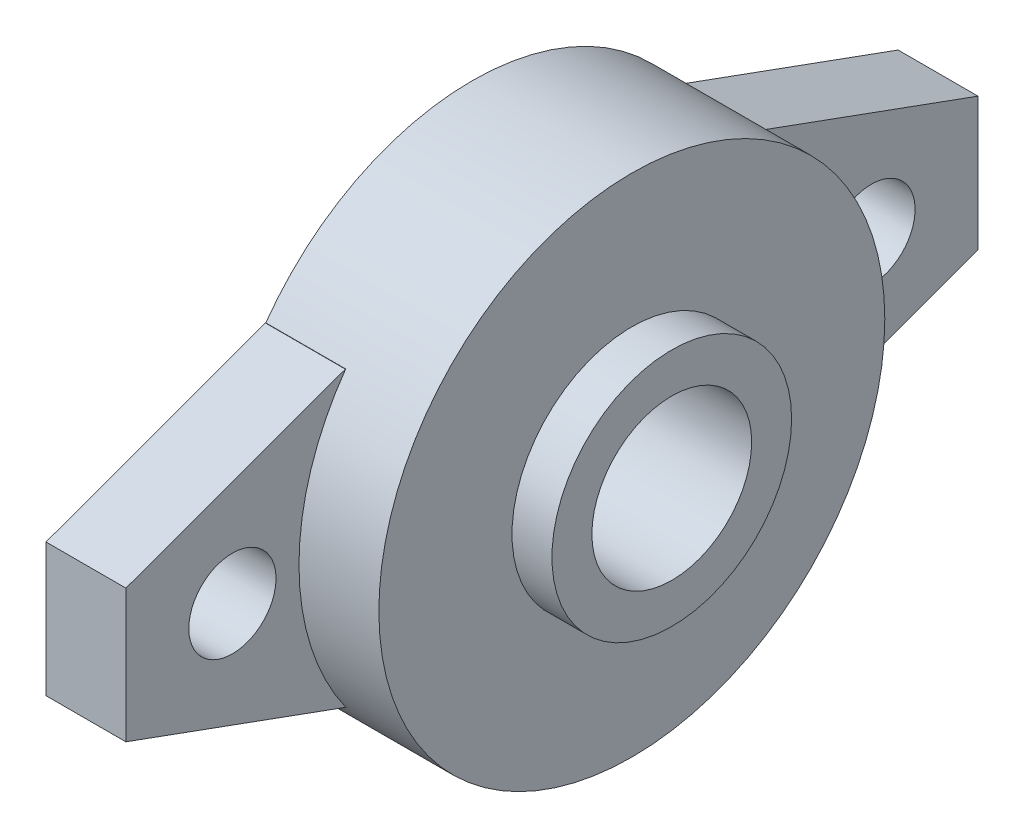
ISO-10303-21;
HEADER;
FILE_DESCRIPTION(('STEP AP214'),'2;1');
FILE_NAME('part.step','',(''),(''),'','','');
FILE_SCHEMA(('AUTOMOTIVE_DESIGN { 1 0 10303 214 1 1 1 1 }'));
ENDSEC;
DATA;
#1=APPLICATION_CONTEXT('core data for automotive mechanical design processes');
#2=APPLICATION_PROTOCOL_DEFINITION('international standard','automotive_design',2000,#1);
#3=PRODUCT_CONTEXT('',#1,'mechanical');
#4=PRODUCT('Part','Part','',(#3));
#5=PRODUCT_RELATED_PRODUCT_CATEGORY('part','',(#4));
#6=PRODUCT_DEFINITION_FORMATION('','',#4);
#7=PRODUCT_DEFINITION_CONTEXT('part definition',#1,'design');
#8=PRODUCT_DEFINITION('design','',#6,#7);
#9=PRODUCT_DEFINITION_SHAPE('','',#8);
#10=(LENGTH_UNIT() NAMED_UNIT(*) SI_UNIT(.MILLI.,.METRE.));
#11=(NAMED_UNIT(*) PLANE_ANGLE_UNIT() SI_UNIT($,.RADIAN.));
#12=(NAMED_UNIT(*) SI_UNIT($,.STERADIAN.) SOLID_ANGLE_UNIT());
#13=UNCERTAINTY_MEASURE_WITH_UNIT(LENGTH_MEASURE(1.E-05),#10,'distance_accuracy_value','');
#14=(GEOMETRIC_REPRESENTATION_CONTEXT(3) GLOBAL_UNCERTAINTY_ASSIGNED_CONTEXT((#13)) GLOBAL_UNIT_ASSIGNED_CONTEXT((#10,
#11,#12)) REPRESENTATION_CONTEXT('',''));
#15=CARTESIAN_POINT('',(0.,0.,0.));
#16=DIRECTION('',(0.,0.,1.));
#17=DIRECTION('',(1.,0.,0.));
#18=AXIS2_PLACEMENT_3D('',#15,#16,#17);
#19=CARTESIAN_POINT('',(12.,0.,0.));
#20=DIRECTION('',(-1.,0.,0.));
#21=DIRECTION('',(0.,0.,1.));
#22=AXIS2_PLACEMENT_3D('',#19,#20,#21);
#23=CYLINDRICAL_SURFACE('',#22,6.);
#24=CARTESIAN_POINT('',(15.,0.,0.));
#25=DIRECTION('',(1.,0.,0.));
#26=DIRECTION('',(0.,0.,-1.));
#27=AXIS2_PLACEMENT_3D('',#24,#25,#26);
#28=CIRCLE('',#27,6.);
#29=CARTESIAN_POINT('',(15.,0.,-6.));
#30=VERTEX_POINT('',#29);
#31=EDGE_CURVE('E188',#30,#30,#28,.T.);
#32=ORIENTED_EDGE('',*,*,#31,.T.);
#33=EDGE_LOOP('',(#32));
#34=FACE_BOUND('',#33,.T.);
#35=CARTESIAN_POINT('',(0.,0.,0.));
#36=DIRECTION('',(-1.,0.,0.));
#37=DIRECTION('',(0.,0.,1.));
#38=AXIS2_PLACEMENT_3D('',#35,#36,#37);
#39=CIRCLE('',#38,6.);
#40=CARTESIAN_POINT('',(0.,0.,6.));
#41=VERTEX_POINT('',#40);
#42=EDGE_CURVE('E306',#41,#41,#39,.T.);
#43=ORIENTED_EDGE('',*,*,#42,.T.);
#44=EDGE_LOOP('',(#43));
#45=FACE_BOUND('',#44,.T.);
#46=ADVANCED_FACE('F40',(#34,#45),#23,.F.);
#47=CARTESIAN_POINT('',(12.,0.,0.));
#48=DIRECTION('',(1.,0.,0.));
#49=DIRECTION('',(0.,0.,-1.));
#50=AXIS2_PLACEMENT_3D('',#47,#48,#49);
#51=PLANE('',#50);
#52=CARTESIAN_POINT('',(12.,0.,0.));
#53=DIRECTION('',(1.,0.,0.));
#54=DIRECTION('',(0.,0.,-1.));
#55=AXIS2_PLACEMENT_3D('',#52,#53,#54);
#56=CIRCLE('',#55,19.);
#57=CARTESIAN_POINT('',(12.,0.,-19.));
#58=VERTEX_POINT('',#57);
#59=EDGE_CURVE('E146',#58,#58,#56,.T.);
#60=ORIENTED_EDGE('',*,*,#59,.T.);
#61=EDGE_LOOP('',(#60));
#62=FACE_BOUND('',#61,.T.);
#63=CARTESIAN_POINT('',(12.,0.,0.));
#64=DIRECTION('',(1.,0.,0.));
#65=DIRECTION('',(0.,0.,-1.));
#66=AXIS2_PLACEMENT_3D('',#63,#64,#65);
#67=CIRCLE('',#66,9.);
#68=CARTESIAN_POINT('',(12.,0.,-9.));
#69=VERTEX_POINT('',#68);
#70=EDGE_CURVE('E192',#69,#69,#67,.T.);
#71=ORIENTED_EDGE('',*,*,#70,.F.);
#72=EDGE_LOOP('',(#71));
#73=FACE_BOUND('',#72,.T.);
#74=ADVANCED_FACE('F317',(#62,#73),#51,.T.);
#75=CARTESIAN_POINT('',(0.,0.,0.));
#76=DIRECTION('',(1.,0.,0.));
#77=DIRECTION('',(0.,0.,-1.));
#78=AXIS2_PLACEMENT_3D('',#75,#76,#77);
#79=PLANE('',#78);
#80=ORIENTED_EDGE('',*,*,#42,.F.);
#81=EDGE_LOOP('',(#80));
#82=FACE_BOUND('',#81,.T.);
#83=CARTESIAN_POINT('',(0.,0.,24.));
#84=DIRECTION('',(-1.,0.,0.));
#85=DIRECTION('',(0.,0.,1.));
#86=AXIS2_PLACEMENT_3D('',#83,#84,#85);
#87=CIRCLE('',#86,3.27585332052941);
#88=CARTESIAN_POINT('',(0.,0.,27.2758533205294));
#89=VERTEX_POINT('',#88);
#90=EDGE_CURVE('E302',#89,#89,#87,.T.);
#91=ORIENTED_EDGE('',*,*,#90,.F.);
#92=EDGE_LOOP('',(#91));
#93=FACE_BOUND('',#92,.T.);
#94=CARTESIAN_POINT('',(0.,0.,-24.));
#95=DIRECTION('',(-1.,0.,0.));
#96=DIRECTION('',(0.,0.,1.));
#97=AXIS2_PLACEMENT_3D('',#94,#95,#96);
#98=CIRCLE('',#97,3.27585332052941);
#99=CARTESIAN_POINT('',(0.,0.,-20.7241466794706));
#100=VERTEX_POINT('',#99);
#101=EDGE_CURVE('E294',#100,#100,#98,.T.);
#102=ORIENTED_EDGE('',*,*,#101,.F.);
#103=EDGE_LOOP('',(#102));
#104=FACE_BOUND('',#103,.T.);
#105=DIRECTION('',(0.,0.,1.));
#106=VECTOR('',#105,1.);
#107=CARTESIAN_POINT('',(0.,-11.,32.));
#108=LINE('',#107,#106);
#109=CARTESIAN_POINT('',(0.,-11.,15.4919333848297));
#110=VERTEX_POINT('',#109);
#111=CARTESIAN_POINT('',(0.,-11.,15.5151354832722));
#112=VERTEX_POINT('',#111);
#113=EDGE_CURVE('E178',#110,#112,#108,.T.);
#114=ORIENTED_EDGE('',*,*,#113,.T.);
#115=DIRECTION('',(0.,-0.342020143325669,-0.939692620785908));
#116=VECTOR('',#115,1.);
#117=CARTESIAN_POINT('',(0.,-11.,15.5151354832722));
#118=LINE('',#117,#116);
#119=CARTESIAN_POINT('',(0.,-4.99999999999998,32.));
#120=VERTEX_POINT('',#119);
#121=EDGE_CURVE('E224',#112,#120,#118,.F.);
#122=ORIENTED_EDGE('',*,*,#121,.T.);
#123=DIRECTION('',(0.,1.,0.));
#124=VECTOR('',#123,1.);
#125=CARTESIAN_POINT('',(0.,-11.,32.));
#126=LINE('',#125,#124);
#127=CARTESIAN_POINT('',(0.,5.,32.));
#128=VERTEX_POINT('',#127);
#129=EDGE_CURVE('E165',#120,#128,#126,.T.);
#130=ORIENTED_EDGE('',*,*,#129,.T.);
#131=DIRECTION('',(0.,-0.342020143325669,0.939692620785908));
#132=VECTOR('',#131,1.);
#133=CARTESIAN_POINT('',(0.,5.,32.));
#134=LINE('',#133,#132);
#135=CARTESIAN_POINT('',(0.,11.,15.5151354832723));
#136=VERTEX_POINT('',#135);
#137=EDGE_CURVE('E218',#128,#136,#134,.F.);
#138=ORIENTED_EDGE('',*,*,#137,.T.);
#139=DIRECTION('',(0.,0.,-1.));
#140=VECTOR('',#139,1.);
#141=CARTESIAN_POINT('',(0.,11.,32.));
#142=LINE('',#141,#140);
#143=CARTESIAN_POINT('',(0.,11.,15.4919333848297));
#144=VERTEX_POINT('',#143);
#145=EDGE_CURVE('E141',#136,#144,#142,.T.);
#146=ORIENTED_EDGE('',*,*,#145,.T.);
#147=CARTESIAN_POINT('',(0.,0.,0.));
#148=DIRECTION('',(1.,0.,0.));
#149=DIRECTION('',(0.,0.,-1.));
#150=AXIS2_PLACEMENT_3D('',#147,#148,#149);
#151=CIRCLE('',#150,19.);
#152=CARTESIAN_POINT('',(0.,11.,-15.4919333848297));
#153=VERTEX_POINT('',#152);
#154=EDGE_CURVE('E134',#153,#144,#151,.T.);
#155=ORIENTED_EDGE('',*,*,#154,.F.);
#156=CARTESIAN_POINT('',(0.,11.,-15.5151354832723));
#157=VERTEX_POINT('',#156);
#158=EDGE_CURVE('E139',#153,#157,#142,.T.);
#159=ORIENTED_EDGE('',*,*,#158,.T.);
#160=DIRECTION('',(0.,0.342020143325669,0.939692620785908));
#161=VECTOR('',#160,1.);
#162=CARTESIAN_POINT('',(0.,11.,-15.5151354832723));
#163=LINE('',#162,#161);
#164=CARTESIAN_POINT('',(0.,5.,-32.));
#165=VERTEX_POINT('',#164);
#166=EDGE_CURVE('E215',#157,#165,#163,.F.);
#167=ORIENTED_EDGE('',*,*,#166,.T.);
#168=DIRECTION('',(0.,-1.,0.));
#169=VECTOR('',#168,1.);
#170=CARTESIAN_POINT('',(0.,-11.,-32.));
#171=LINE('',#170,#169);
#172=CARTESIAN_POINT('',(0.,-5.,-32.));
#173=VERTEX_POINT('',#172);
#174=EDGE_CURVE('E169',#165,#173,#171,.T.);
#175=ORIENTED_EDGE('',*,*,#174,.T.);
#176=DIRECTION('',(0.,0.342020143325669,-0.939692620785908));
#177=VECTOR('',#176,1.);
#178=CARTESIAN_POINT('',(0.,-4.99999999999999,-32.));
#179=LINE('',#178,#177);
#180=CARTESIAN_POINT('',(0.,-11.,-15.5151354832723));
#181=VERTEX_POINT('',#180);
#182=EDGE_CURVE('E221',#173,#181,#179,.F.);
#183=ORIENTED_EDGE('',*,*,#182,.T.);
#184=CARTESIAN_POINT('',(0.,-11.,-15.4919333848297));
#185=VERTEX_POINT('',#184);
#186=EDGE_CURVE('E179',#181,#185,#108,.T.);
#187=ORIENTED_EDGE('',*,*,#186,.T.);
#188=EDGE_CURVE('E147',#110,#185,#151,.T.);
#189=ORIENTED_EDGE('',*,*,#188,.F.);
#190=EDGE_LOOP('',(#114,#122,#130,#138,#146,#155,#159,#167,#175,#183,#187,#189));
#191=FACE_BOUND('',#190,.T.);
#192=ADVANCED_FACE('F137',(#82,#93,#104,#191),#79,.F.);
#193=CARTESIAN_POINT('',(12.,0.,0.));
#194=DIRECTION('',(-1.,0.,0.));
#195=DIRECTION('',(0.,0.,1.));
#196=AXIS2_PLACEMENT_3D('',#193,#194,#195);
#197=CYLINDRICAL_SURFACE('',#196,19.);
#198=ORIENTED_EDGE('',*,*,#188,.T.);
#199=DIRECTION('',(-1.,0.,0.));
#200=VECTOR('',#199,1.);
#201=CARTESIAN_POINT('',(12.,-11.,-15.4919333848297));
#202=LINE('',#201,#200);
#203=CARTESIAN_POINT('',(6.,-11.,-15.4919333848297));
#204=VERTEX_POINT('',#203);
#205=EDGE_CURVE('E159',#185,#204,#202,.F.);
#206=ORIENTED_EDGE('',*,*,#205,.T.);
#207=CARTESIAN_POINT('',(6.,0.,0.));
#208=DIRECTION('',(-1.,0.,0.));
#209=DIRECTION('',(0.,0.,1.));
#210=AXIS2_PLACEMENT_3D('',#207,#208,#209);
#211=CIRCLE('',#210,19.);
#212=CARTESIAN_POINT('',(6.,11.,-15.4919333848297));
#213=VERTEX_POINT('',#212);
#214=EDGE_CURVE('E156',#213,#204,#211,.T.);
#215=ORIENTED_EDGE('',*,*,#214,.F.);
#216=DIRECTION('',(-1.,0.,0.));
#217=VECTOR('',#216,1.);
#218=CARTESIAN_POINT('',(12.,11.,-15.4919333848297));
#219=LINE('',#218,#217);
#220=EDGE_CURVE('E150',#213,#153,#219,.T.);
#221=ORIENTED_EDGE('',*,*,#220,.T.);
#222=ORIENTED_EDGE('',*,*,#154,.T.);
#223=DIRECTION('',(-1.,0.,0.));
#224=VECTOR('',#223,1.);
#225=CARTESIAN_POINT('',(12.,11.,15.4919333848297));
#226=LINE('',#225,#224);
#227=CARTESIAN_POINT('',(6.,11.,15.4919333848297));
#228=VERTEX_POINT('',#227);
#229=EDGE_CURVE('E202',#144,#228,#226,.F.);
#230=ORIENTED_EDGE('',*,*,#229,.T.);
#231=CARTESIAN_POINT('',(6.,-11.,15.4919333848297));
#232=VERTEX_POINT('',#231);
#233=EDGE_CURVE('E183',#232,#228,#211,.T.);
#234=ORIENTED_EDGE('',*,*,#233,.F.);
#235=DIRECTION('',(-1.,0.,0.));
#236=VECTOR('',#235,1.);
#237=CARTESIAN_POINT('',(12.,-11.,15.4919333848297));
#238=LINE('',#237,#236);
#239=EDGE_CURVE('E160',#232,#110,#238,.T.);
#240=ORIENTED_EDGE('',*,*,#239,.T.);
#241=EDGE_LOOP('',(#198,#206,#215,#221,#222,#230,#234,#240));
#242=FACE_BOUND('',#241,.T.);
#243=ORIENTED_EDGE('',*,*,#59,.F.);
#244=EDGE_LOOP('',(#243));
#245=FACE_BOUND('',#244,.T.);
#246=ADVANCED_FACE('F152',(#242,#245),#197,.T.);
#247=CARTESIAN_POINT('',(15.,0.,0.));
#248=DIRECTION('',(1.,0.,0.));
#249=DIRECTION('',(0.,0.,-1.));
#250=AXIS2_PLACEMENT_3D('',#247,#248,#249);
#251=PLANE('',#250);
#252=CARTESIAN_POINT('',(15.,0.,0.));
#253=DIRECTION('',(1.,0.,0.));
#254=DIRECTION('',(0.,0.,-1.));
#255=AXIS2_PLACEMENT_3D('',#252,#253,#254);
#256=CIRCLE('',#255,9.);
#257=CARTESIAN_POINT('',(15.,0.,-9.));
#258=VERTEX_POINT('',#257);
#259=EDGE_CURVE('E193',#258,#258,#256,.T.);
#260=ORIENTED_EDGE('',*,*,#259,.T.);
#261=EDGE_LOOP('',(#260));
#262=FACE_BOUND('',#261,.T.);
#263=ORIENTED_EDGE('',*,*,#31,.F.);
#264=EDGE_LOOP('',(#263));
#265=FACE_BOUND('',#264,.T.);
#266=ADVANCED_FACE('F351',(#262,#265),#251,.T.);
#267=CARTESIAN_POINT('',(15.,0.,0.));
#268=DIRECTION('',(-1.,0.,0.));
#269=DIRECTION('',(0.,0.,1.));
#270=AXIS2_PLACEMENT_3D('',#267,#268,#269);
#271=CYLINDRICAL_SURFACE('',#270,9.);
#272=ORIENTED_EDGE('',*,*,#259,.F.);
#273=EDGE_LOOP('',(#272));
#274=FACE_BOUND('',#273,.T.);
#275=ORIENTED_EDGE('',*,*,#70,.T.);
#276=EDGE_LOOP('',(#275));
#277=FACE_BOUND('',#276,.T.);
#278=ADVANCED_FACE('F346',(#274,#277),#271,.T.);
#279=CARTESIAN_POINT('',(6.,-11.,32.));
#280=DIRECTION('',(0.,0.,1.));
#281=DIRECTION('',(0.,-1.,0.));
#282=AXIS2_PLACEMENT_3D('',#279,#280,#281);
#283=PLANE('',#282);
#284=ORIENTED_EDGE('',*,*,#129,.F.);
#285=DIRECTION('',(1.,0.,0.));
#286=VECTOR('',#285,1.);
#287=CARTESIAN_POINT('',(6.,-4.99999999999998,32.));
#288=LINE('',#287,#286);
#289=CARTESIAN_POINT('',(6.,-4.99999999999998,32.));
#290=VERTEX_POINT('',#289);
#291=EDGE_CURVE('E231',#120,#290,#288,.T.);
#292=ORIENTED_EDGE('',*,*,#291,.T.);
#293=DIRECTION('',(0.,1.,0.));
#294=VECTOR('',#293,1.);
#295=CARTESIAN_POINT('',(6.,-11.,32.));
#296=LINE('',#295,#294);
#297=CARTESIAN_POINT('',(6.,5.,32.));
#298=VERTEX_POINT('',#297);
#299=EDGE_CURVE('E182',#290,#298,#296,.T.);
#300=ORIENTED_EDGE('',*,*,#299,.T.);
#301=DIRECTION('',(-1.,0.,0.));
#302=VECTOR('',#301,1.);
#303=CARTESIAN_POINT('',(6.,5.,32.));
#304=LINE('',#303,#302);
#305=EDGE_CURVE('E227',#298,#128,#304,.T.);
#306=ORIENTED_EDGE('',*,*,#305,.T.);
#307=EDGE_LOOP('',(#284,#292,#300,#306));
#308=FACE_BOUND('',#307,.T.);
#309=ADVANCED_FACE('F274',(#308),#283,.T.);
#310=CARTESIAN_POINT('',(6.,0.,0.));
#311=DIRECTION('',(-1.,0.,0.));
#312=DIRECTION('',(0.,0.,1.));
#313=AXIS2_PLACEMENT_3D('',#310,#311,#312);
#314=PLANE('',#313);
#315=CARTESIAN_POINT('',(6.,0.,24.));
#316=DIRECTION('',(-1.,0.,0.));
#317=DIRECTION('',(0.,0.,1.));
#318=AXIS2_PLACEMENT_3D('',#315,#316,#317);
#319=CIRCLE('',#318,3.27585332052941);
#320=CARTESIAN_POINT('',(6.,0.,27.2758533205294));
#321=VERTEX_POINT('',#320);
#322=EDGE_CURVE('E298',#321,#321,#319,.T.);
#323=ORIENTED_EDGE('',*,*,#322,.T.);
#324=EDGE_LOOP('',(#323));
#325=FACE_BOUND('',#324,.T.);
#326=ORIENTED_EDGE('',*,*,#299,.F.);
#327=DIRECTION('',(0.,0.342020143325669,0.939692620785908));
#328=VECTOR('',#327,1.);
#329=CARTESIAN_POINT('',(6.,-11.,15.5151354832722));
#330=LINE('',#329,#328);
#331=CARTESIAN_POINT('',(6.,-11.,15.5151354832722));
#332=VERTEX_POINT('',#331);
#333=EDGE_CURVE('E237',#290,#332,#330,.F.);
#334=ORIENTED_EDGE('',*,*,#333,.T.);
#335=DIRECTION('',(0.,0.,1.));
#336=VECTOR('',#335,1.);
#337=CARTESIAN_POINT('',(6.,-11.,32.));
#338=LINE('',#337,#336);
#339=EDGE_CURVE('E285',#232,#332,#338,.T.);
#340=ORIENTED_EDGE('',*,*,#339,.F.);
#341=ORIENTED_EDGE('',*,*,#233,.T.);
#342=DIRECTION('',(0.,0.,-1.));
#343=VECTOR('',#342,1.);
#344=CARTESIAN_POINT('',(6.,11.,32.));
#345=LINE('',#344,#343);
#346=CARTESIAN_POINT('',(6.,11.,15.5151354832723));
#347=VERTEX_POINT('',#346);
#348=EDGE_CURVE('E258',#347,#228,#345,.T.);
#349=ORIENTED_EDGE('',*,*,#348,.F.);
#350=DIRECTION('',(0.,0.342020143325669,-0.939692620785908));
#351=VECTOR('',#350,1.);
#352=CARTESIAN_POINT('',(6.,5.,32.));
#353=LINE('',#352,#351);
#354=EDGE_CURVE('E234',#347,#298,#353,.F.);
#355=ORIENTED_EDGE('',*,*,#354,.T.);
#356=EDGE_LOOP('',(#326,#334,#340,#341,#349,#355));
#357=FACE_BOUND('',#356,.T.);
#358=ADVANCED_FACE('F263',(#325,#357),#314,.F.);
#359=CARTESIAN_POINT('',(6.,11.,32.));
#360=DIRECTION('',(0.,1.,0.));
#361=DIRECTION('',(0.,0.,1.));
#362=AXIS2_PLACEMENT_3D('',#359,#360,#361);
#363=PLANE('',#362);
#364=ORIENTED_EDGE('',*,*,#145,.F.);
#365=DIRECTION('',(1.,0.,0.));
#366=VECTOR('',#365,1.);
#367=CARTESIAN_POINT('',(6.,11.,15.5151354832723));
#368=LINE('',#367,#366);
#369=EDGE_CURVE('E50',#136,#347,#368,.T.);
#370=ORIENTED_EDGE('',*,*,#369,.T.);
#371=ORIENTED_EDGE('',*,*,#348,.T.);
#372=ORIENTED_EDGE('',*,*,#229,.F.);
#373=EDGE_LOOP('',(#364,#370,#371,#372));
#374=FACE_BOUND('',#373,.T.);
#375=ADVANCED_FACE('F257',(#374),#363,.T.);
#376=CARTESIAN_POINT('',(6.,-11.,32.));
#377=DIRECTION('',(0.,-1.,0.));
#378=DIRECTION('',(0.,0.,-1.));
#379=AXIS2_PLACEMENT_3D('',#376,#377,#378);
#380=PLANE('',#379);
#381=ORIENTED_EDGE('',*,*,#339,.T.);
#382=DIRECTION('',(-1.,0.,0.));
#383=VECTOR('',#382,1.);
#384=CARTESIAN_POINT('',(6.,-11.,15.5151354832722));
#385=LINE('',#384,#383);
#386=EDGE_CURVE('E211',#332,#112,#385,.T.);
#387=ORIENTED_EDGE('',*,*,#386,.T.);
#388=ORIENTED_EDGE('',*,*,#113,.F.);
#389=ORIENTED_EDGE('',*,*,#239,.F.);
#390=EDGE_LOOP('',(#381,#387,#388,#389));
#391=FACE_BOUND('',#390,.T.);
#392=ADVANCED_FACE('F283',(#391),#380,.T.);
#393=ORIENTED_EDGE('',*,*,#186,.F.);
#394=DIRECTION('',(1.,0.,0.));
#395=VECTOR('',#394,1.);
#396=CARTESIAN_POINT('',(6.,-11.,-15.5151354832723));
#397=LINE('',#396,#395);
#398=CARTESIAN_POINT('',(6.,-11.,-15.5151354832723));
#399=VERTEX_POINT('',#398);
#400=EDGE_CURVE('E65',#181,#399,#397,.T.);
#401=ORIENTED_EDGE('',*,*,#400,.T.);
#402=EDGE_CURVE('E187',#399,#204,#338,.T.);
#403=ORIENTED_EDGE('',*,*,#402,.T.);
#404=ORIENTED_EDGE('',*,*,#205,.F.);
#405=EDGE_LOOP('',(#393,#401,#403,#404));
#406=FACE_BOUND('',#405,.T.);
#407=ADVANCED_FACE('F462',(#406),#380,.T.);
#408=CARTESIAN_POINT('',(6.,11.,-15.5151354832723));
#409=VERTEX_POINT('',#408);
#410=EDGE_CURVE('E268',#213,#409,#345,.T.);
#411=ORIENTED_EDGE('',*,*,#410,.T.);
#412=DIRECTION('',(-1.,0.,0.));
#413=VECTOR('',#412,1.);
#414=CARTESIAN_POINT('',(6.,11.,-15.5151354832723));
#415=LINE('',#414,#413);
#416=EDGE_CURVE('E11',#409,#157,#415,.T.);
#417=ORIENTED_EDGE('',*,*,#416,.T.);
#418=ORIENTED_EDGE('',*,*,#158,.F.);
#419=ORIENTED_EDGE('',*,*,#220,.F.);
#420=EDGE_LOOP('',(#411,#417,#418,#419));
#421=FACE_BOUND('',#420,.T.);
#422=ADVANCED_FACE('F162',(#421),#363,.T.);
#423=CARTESIAN_POINT('',(6.,0.,-24.));
#424=DIRECTION('',(-1.,0.,0.));
#425=DIRECTION('',(0.,0.,1.));
#426=AXIS2_PLACEMENT_3D('',#423,#424,#425);
#427=CIRCLE('',#426,3.27585332052941);
#428=CARTESIAN_POINT('',(6.,0.,-20.7241466794706));
#429=VERTEX_POINT('',#428);
#430=EDGE_CURVE('E171',#429,#429,#427,.T.);
#431=ORIENTED_EDGE('',*,*,#430,.T.);
#432=EDGE_LOOP('',(#431));
#433=FACE_BOUND('',#432,.T.);
#434=ORIENTED_EDGE('',*,*,#402,.F.);
#435=DIRECTION('',(0.,-0.342020143325669,0.939692620785908));
#436=VECTOR('',#435,1.);
#437=CARTESIAN_POINT('',(6.,-4.99999999999999,-32.));
#438=LINE('',#437,#436);
#439=CARTESIAN_POINT('',(6.,-5.,-32.));
#440=VERTEX_POINT('',#439);
#441=EDGE_CURVE('E251',#399,#440,#438,.F.);
#442=ORIENTED_EDGE('',*,*,#441,.T.);
#443=DIRECTION('',(0.,-1.,0.));
#444=VECTOR('',#443,1.);
#445=CARTESIAN_POINT('',(6.,-11.,-32.));
#446=LINE('',#445,#444);
#447=CARTESIAN_POINT('',(6.,5.,-32.));
#448=VERTEX_POINT('',#447);
#449=EDGE_CURVE('E267',#448,#440,#446,.T.);
#450=ORIENTED_EDGE('',*,*,#449,.F.);
#451=DIRECTION('',(0.,-0.342020143325669,-0.939692620785908));
#452=VECTOR('',#451,1.);
#453=CARTESIAN_POINT('',(6.,11.,-15.5151354832723));
#454=LINE('',#453,#452);
#455=EDGE_CURVE('E57',#448,#409,#454,.F.);
#456=ORIENTED_EDGE('',*,*,#455,.T.);
#457=ORIENTED_EDGE('',*,*,#410,.F.);
#458=ORIENTED_EDGE('',*,*,#214,.T.);
#459=EDGE_LOOP('',(#434,#442,#450,#456,#457,#458));
#460=FACE_BOUND('',#459,.T.);
#461=ADVANCED_FACE('F382',(#433,#460),#314,.F.);
#462=CARTESIAN_POINT('',(6.,-11.,-32.));
#463=DIRECTION('',(0.,0.,-1.));
#464=DIRECTION('',(0.,1.,0.));
#465=AXIS2_PLACEMENT_3D('',#462,#463,#464);
#466=PLANE('',#465);
#467=ORIENTED_EDGE('',*,*,#449,.T.);
#468=DIRECTION('',(-1.,0.,0.));
#469=VECTOR('',#468,1.);
#470=CARTESIAN_POINT('',(6.,-5.,-32.));
#471=LINE('',#470,#469);
#472=EDGE_CURVE('E243',#440,#173,#471,.T.);
#473=ORIENTED_EDGE('',*,*,#472,.T.);
#474=ORIENTED_EDGE('',*,*,#174,.F.);
#475=DIRECTION('',(1.,0.,0.));
#476=VECTOR('',#475,1.);
#477=CARTESIAN_POINT('',(6.,5.,-32.));
#478=LINE('',#477,#476);
#479=EDGE_CURVE('E240',#165,#448,#478,.T.);
#480=ORIENTED_EDGE('',*,*,#479,.T.);
#481=EDGE_LOOP('',(#467,#473,#474,#480));
#482=FACE_BOUND('',#481,.T.);
#483=ADVANCED_FACE('F359',(#482),#466,.T.);
#484=CARTESIAN_POINT('',(6.,-11.,15.5151354832722));
#485=DIRECTION('',(0.,0.939692620785908,-0.342020143325669));
#486=DIRECTION('',(-1.,0.,0.));
#487=AXIS2_PLACEMENT_3D('',#484,#485,#486);
#488=PLANE('',#487);
#489=ORIENTED_EDGE('',*,*,#333,.F.);
#490=ORIENTED_EDGE('',*,*,#291,.F.);
#491=ORIENTED_EDGE('',*,*,#121,.F.);
#492=ORIENTED_EDGE('',*,*,#386,.F.);
#493=EDGE_LOOP('',(#489,#490,#491,#492));
#494=FACE_BOUND('',#493,.T.);
#495=ADVANCED_FACE('F280',(#494),#488,.F.);
#496=CARTESIAN_POINT('',(6.,-4.99999999999999,-32.));
#497=DIRECTION('',(0.,0.939692620785908,0.342020143325669));
#498=DIRECTION('',(-1.,0.,0.));
#499=AXIS2_PLACEMENT_3D('',#496,#497,#498);
#500=PLANE('',#499);
#501=ORIENTED_EDGE('',*,*,#441,.F.);
#502=ORIENTED_EDGE('',*,*,#400,.F.);
#503=ORIENTED_EDGE('',*,*,#182,.F.);
#504=ORIENTED_EDGE('',*,*,#472,.F.);
#505=EDGE_LOOP('',(#501,#502,#503,#504));
#506=FACE_BOUND('',#505,.T.);
#507=ADVANCED_FACE('F358',(#506),#500,.F.);
#508=CARTESIAN_POINT('',(6.,5.,32.));
#509=DIRECTION('',(0.,-0.939692620785908,-0.342020143325669));
#510=DIRECTION('',(-1.,0.,0.));
#511=AXIS2_PLACEMENT_3D('',#508,#509,#510);
#512=PLANE('',#511);
#513=ORIENTED_EDGE('',*,*,#354,.F.);
#514=ORIENTED_EDGE('',*,*,#369,.F.);
#515=ORIENTED_EDGE('',*,*,#137,.F.);
#516=ORIENTED_EDGE('',*,*,#305,.F.);
#517=EDGE_LOOP('',(#513,#514,#515,#516));
#518=FACE_BOUND('',#517,.T.);
#519=ADVANCED_FACE('F271',(#518),#512,.F.);
#520=CARTESIAN_POINT('',(6.,11.,-15.5151354832723));
#521=DIRECTION('',(0.,-0.939692620785908,0.342020143325669));
#522=DIRECTION('',(-1.,0.,0.));
#523=AXIS2_PLACEMENT_3D('',#520,#521,#522);
#524=PLANE('',#523);
#525=ORIENTED_EDGE('',*,*,#455,.F.);
#526=ORIENTED_EDGE('',*,*,#479,.F.);
#527=ORIENTED_EDGE('',*,*,#166,.F.);
#528=ORIENTED_EDGE('',*,*,#416,.F.);
#529=EDGE_LOOP('',(#525,#526,#527,#528));
#530=FACE_BOUND('',#529,.T.);
#531=ADVANCED_FACE('F43',(#530),#524,.F.);
#532=CARTESIAN_POINT('',(6.,0.,-24.));
#533=DIRECTION('',(-1.,0.,0.));
#534=DIRECTION('',(0.,0.,1.));
#535=AXIS2_PLACEMENT_3D('',#532,#533,#534);
#536=CYLINDRICAL_SURFACE('',#535,3.27585332052941);
#537=ORIENTED_EDGE('',*,*,#430,.F.);
#538=EDGE_LOOP('',(#537));
#539=FACE_BOUND('',#538,.T.);
#540=ORIENTED_EDGE('',*,*,#101,.T.);
#541=EDGE_LOOP('',(#540));
#542=FACE_BOUND('',#541,.T.);
#543=ADVANCED_FACE('F323',(#539,#542),#536,.F.);
#544=CARTESIAN_POINT('',(6.,0.,24.));
#545=DIRECTION('',(-1.,0.,0.));
#546=DIRECTION('',(0.,0.,1.));
#547=AXIS2_PLACEMENT_3D('',#544,#545,#546);
#548=CYLINDRICAL_SURFACE('',#547,3.27585332052941);
#549=ORIENTED_EDGE('',*,*,#322,.F.);
#550=EDGE_LOOP('',(#549));
#551=FACE_BOUND('',#550,.T.);
#552=ORIENTED_EDGE('',*,*,#90,.T.);
#553=EDGE_LOOP('',(#552));
#554=FACE_BOUND('',#553,.T.);
#555=ADVANCED_FACE('F325',(#551,#554),#548,.F.);
#556=CLOSED_SHELL('',(#46,#74,#192,#246,#266,#278,#309,#358,#375,#392,#407,#422,#461,#483,#495,
#507,#519,#531,#543,#555));
#557=MANIFOLD_SOLID_BREP('B2',#556);
#558=ADVANCED_BREP_SHAPE_REPRESENTATION('',(#18,#557),#14);
#559=SHAPE_DEFINITION_REPRESENTATION(#9,#558);
ENDSEC;
END-ISO-10303-21;
